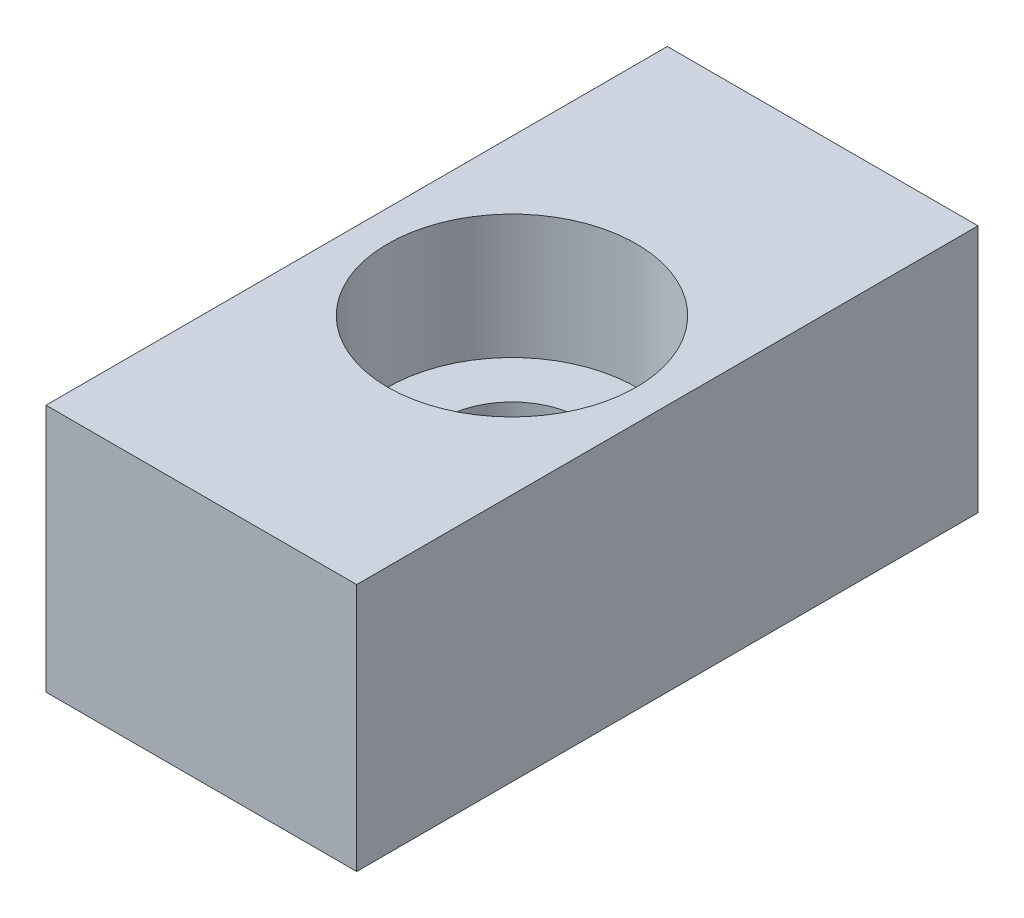
ISO-10303-21;
HEADER;
FILE_DESCRIPTION(('STEP AP214'),'2;1');
FILE_NAME('part.step','',(''),(''),'','','');
FILE_SCHEMA(('AUTOMOTIVE_DESIGN { 1 0 10303 214 1 1 1 1 }'));
ENDSEC;
DATA;
#1=APPLICATION_CONTEXT('core data for automotive mechanical design processes');
#2=APPLICATION_PROTOCOL_DEFINITION('international standard','automotive_design',2000,#1);
#3=PRODUCT_CONTEXT('',#1,'mechanical');
#4=PRODUCT('Part','Part','',(#3));
#5=PRODUCT_RELATED_PRODUCT_CATEGORY('part','',(#4));
#6=PRODUCT_DEFINITION_FORMATION('','',#4);
#7=PRODUCT_DEFINITION_CONTEXT('part definition',#1,'design');
#8=PRODUCT_DEFINITION('design','',#6,#7);
#9=PRODUCT_DEFINITION_SHAPE('','',#8);
#10=(LENGTH_UNIT() NAMED_UNIT(*) SI_UNIT(.MILLI.,.METRE.));
#11=(NAMED_UNIT(*) PLANE_ANGLE_UNIT() SI_UNIT($,.RADIAN.));
#12=(NAMED_UNIT(*) SI_UNIT($,.STERADIAN.) SOLID_ANGLE_UNIT());
#13=UNCERTAINTY_MEASURE_WITH_UNIT(LENGTH_MEASURE(1.E-05),#10,'distance_accuracy_value','');
#14=(GEOMETRIC_REPRESENTATION_CONTEXT(3) GLOBAL_UNCERTAINTY_ASSIGNED_CONTEXT((#13)) GLOBAL_UNIT_ASSIGNED_CONTEXT((#10,
#11,#12)) REPRESENTATION_CONTEXT('',''));
#15=CARTESIAN_POINT('',(0.,0.,0.));
#16=DIRECTION('',(0.,0.,1.));
#17=DIRECTION('',(1.,0.,0.));
#18=AXIS2_PLACEMENT_3D('',#15,#16,#17);
#19=CARTESIAN_POINT('',(0.,4.,0.));
#20=DIRECTION('',(0.,-1.,0.));
#21=DIRECTION('',(0.,0.,-1.));
#22=AXIS2_PLACEMENT_3D('',#19,#20,#21);
#23=PLANE('',#22);
#24=CARTESIAN_POINT('',(0.,4.,0.));
#25=DIRECTION('',(0.,1.,0.));
#26=DIRECTION('',(0.,0.,1.));
#27=AXIS2_PLACEMENT_3D('',#24,#25,#26);
#28=CIRCLE('',#27,2.25);
#29=CARTESIAN_POINT('',(0.,4.,2.25));
#30=VERTEX_POINT('',#29);
#31=EDGE_CURVE('E116',#30,#30,#28,.T.);
#32=ORIENTED_EDGE('',*,*,#31,.F.);
#33=EDGE_LOOP('',(#32));
#34=FACE_BOUND('',#33,.T.);
#35=CARTESIAN_POINT('',(0.,4.,0.));
#36=DIRECTION('',(0.,1.,0.));
#37=DIRECTION('',(0.,0.,1.));
#38=AXIS2_PLACEMENT_3D('',#35,#36,#37);
#39=CIRCLE('',#38,4.);
#40=CARTESIAN_POINT('',(0.,4.,4.));
#41=VERTEX_POINT('',#40);
#42=EDGE_CURVE('E107',#41,#41,#39,.T.);
#43=ORIENTED_EDGE('',*,*,#42,.T.);
#44=EDGE_LOOP('',(#43));
#45=FACE_BOUND('',#44,.T.);
#46=ADVANCED_FACE('F39',(#34,#45),#23,.F.);
#47=CARTESIAN_POINT('',(0.,0.,0.));
#48=DIRECTION('',(0.,-1.,0.));
#49=DIRECTION('',(0.,0.,-1.));
#50=AXIS2_PLACEMENT_3D('',#47,#48,#49);
#51=PLANE('',#50);
#52=DIRECTION('',(0.,0.,-1.));
#53=VECTOR('',#52,1.);
#54=CARTESIAN_POINT('',(5.,0.,10.));
#55=LINE('',#54,#53);
#56=CARTESIAN_POINT('',(5.,0.,10.));
#57=VERTEX_POINT('',#56);
#58=CARTESIAN_POINT('',(5.,0.,-10.));
#59=VERTEX_POINT('',#58);
#60=EDGE_CURVE('E120',#57,#59,#55,.T.);
#61=ORIENTED_EDGE('',*,*,#60,.F.);
#62=DIRECTION('',(1.,0.,0.));
#63=VECTOR('',#62,1.);
#64=CARTESIAN_POINT('',(-5.,0.,10.));
#65=LINE('',#64,#63);
#66=CARTESIAN_POINT('',(-5.,0.,10.));
#67=VERTEX_POINT('',#66);
#68=EDGE_CURVE('E55',#67,#57,#65,.T.);
#69=ORIENTED_EDGE('',*,*,#68,.F.);
#70=DIRECTION('',(0.,0.,1.));
#71=VECTOR('',#70,1.);
#72=CARTESIAN_POINT('',(-5.,0.,10.));
#73=LINE('',#72,#71);
#74=CARTESIAN_POINT('',(-5.,0.,-10.));
#75=VERTEX_POINT('',#74);
#76=EDGE_CURVE('E63',#75,#67,#73,.T.);
#77=ORIENTED_EDGE('',*,*,#76,.F.);
#78=DIRECTION('',(-1.,0.,0.));
#79=VECTOR('',#78,1.);
#80=CARTESIAN_POINT('',(-5.,0.,-10.));
#81=LINE('',#80,#79);
#82=EDGE_CURVE('E127',#59,#75,#81,.T.);
#83=ORIENTED_EDGE('',*,*,#82,.F.);
#84=EDGE_LOOP('',(#61,#69,#77,#83));
#85=FACE_BOUND('',#84,.T.);
#86=CARTESIAN_POINT('',(0.,0.,0.));
#87=DIRECTION('',(0.,1.,0.));
#88=DIRECTION('',(0.,0.,1.));
#89=AXIS2_PLACEMENT_3D('',#86,#87,#88);
#90=CIRCLE('',#89,2.25);
#91=CARTESIAN_POINT('',(0.,0.,2.25));
#92=VERTEX_POINT('',#91);
#93=EDGE_CURVE('E115',#92,#92,#90,.T.);
#94=ORIENTED_EDGE('',*,*,#93,.T.);
#95=EDGE_LOOP('',(#94));
#96=FACE_BOUND('',#95,.T.);
#97=ADVANCED_FACE('F139',(#85,#96),#51,.T.);
#98=CARTESIAN_POINT('',(5.,4.,10.));
#99=DIRECTION('',(-1.,0.,0.));
#100=DIRECTION('',(0.,0.,1.));
#101=AXIS2_PLACEMENT_3D('',#98,#99,#100);
#102=PLANE('',#101);
#103=ORIENTED_EDGE('',*,*,#60,.T.);
#104=DIRECTION('',(0.,-1.,0.));
#105=VECTOR('',#104,1.);
#106=CARTESIAN_POINT('',(5.,4.,-10.));
#107=LINE('',#106,#105);
#108=CARTESIAN_POINT('',(5.,8.,-10.));
#109=VERTEX_POINT('',#108);
#110=EDGE_CURVE('E11',#109,#59,#107,.T.);
#111=ORIENTED_EDGE('',*,*,#110,.F.);
#112=DIRECTION('',(0.,0.,-1.));
#113=VECTOR('',#112,1.);
#114=CARTESIAN_POINT('',(5.,8.,-10.));
#115=LINE('',#114,#113);
#116=CARTESIAN_POINT('',(5.,8.,10.));
#117=VERTEX_POINT('',#116);
#118=EDGE_CURVE('E95',#117,#109,#115,.T.);
#119=ORIENTED_EDGE('',*,*,#118,.F.);
#120=DIRECTION('',(0.,-1.,0.));
#121=VECTOR('',#120,1.);
#122=CARTESIAN_POINT('',(5.,4.,10.));
#123=LINE('',#122,#121);
#124=EDGE_CURVE('E86',#117,#57,#123,.T.);
#125=ORIENTED_EDGE('',*,*,#124,.T.);
#126=EDGE_LOOP('',(#103,#111,#119,#125));
#127=FACE_BOUND('',#126,.T.);
#128=ADVANCED_FACE('F41',(#127),#102,.F.);
#129=CARTESIAN_POINT('',(-5.,4.,-10.));
#130=DIRECTION('',(0.,0.,1.));
#131=DIRECTION('',(1.,0.,0.));
#132=AXIS2_PLACEMENT_3D('',#129,#130,#131);
#133=PLANE('',#132);
#134=ORIENTED_EDGE('',*,*,#82,.T.);
#135=DIRECTION('',(0.,-1.,0.));
#136=VECTOR('',#135,1.);
#137=CARTESIAN_POINT('',(-5.,4.,-10.));
#138=LINE('',#137,#136);
#139=CARTESIAN_POINT('',(-5.,8.,-10.));
#140=VERTEX_POINT('',#139);
#141=EDGE_CURVE('E48',#140,#75,#138,.T.);
#142=ORIENTED_EDGE('',*,*,#141,.F.);
#143=DIRECTION('',(-1.,0.,0.));
#144=VECTOR('',#143,1.);
#145=CARTESIAN_POINT('',(-5.,8.,-10.));
#146=LINE('',#145,#144);
#147=EDGE_CURVE('E101',#109,#140,#146,.T.);
#148=ORIENTED_EDGE('',*,*,#147,.F.);
#149=ORIENTED_EDGE('',*,*,#110,.T.);
#150=EDGE_LOOP('',(#134,#142,#148,#149));
#151=FACE_BOUND('',#150,.T.);
#152=ADVANCED_FACE('F142',(#151),#133,.F.);
#153=CARTESIAN_POINT('',(-5.,4.,10.));
#154=DIRECTION('',(1.,0.,0.));
#155=DIRECTION('',(0.,0.,-1.));
#156=AXIS2_PLACEMENT_3D('',#153,#154,#155);
#157=PLANE('',#156);
#158=ORIENTED_EDGE('',*,*,#76,.T.);
#159=DIRECTION('',(0.,-1.,0.));
#160=VECTOR('',#159,1.);
#161=CARTESIAN_POINT('',(-5.,4.,10.));
#162=LINE('',#161,#160);
#163=CARTESIAN_POINT('',(-5.,8.,10.));
#164=VERTEX_POINT('',#163);
#165=EDGE_CURVE('E80',#164,#67,#162,.T.);
#166=ORIENTED_EDGE('',*,*,#165,.F.);
#167=DIRECTION('',(0.,0.,1.));
#168=VECTOR('',#167,1.);
#169=CARTESIAN_POINT('',(-5.,8.,-10.));
#170=LINE('',#169,#168);
#171=EDGE_CURVE('E84',#140,#164,#170,.T.);
#172=ORIENTED_EDGE('',*,*,#171,.F.);
#173=ORIENTED_EDGE('',*,*,#141,.T.);
#174=EDGE_LOOP('',(#158,#166,#172,#173));
#175=FACE_BOUND('',#174,.T.);
#176=ADVANCED_FACE('F82',(#175),#157,.F.);
#177=CARTESIAN_POINT('',(-5.,4.,10.));
#178=DIRECTION('',(0.,0.,-1.));
#179=DIRECTION('',(-1.,0.,0.));
#180=AXIS2_PLACEMENT_3D('',#177,#178,#179);
#181=PLANE('',#180);
#182=ORIENTED_EDGE('',*,*,#68,.T.);
#183=ORIENTED_EDGE('',*,*,#124,.F.);
#184=DIRECTION('',(1.,0.,0.));
#185=VECTOR('',#184,1.);
#186=CARTESIAN_POINT('',(-5.,8.,10.));
#187=LINE('',#186,#185);
#188=EDGE_CURVE('E89',#164,#117,#187,.T.);
#189=ORIENTED_EDGE('',*,*,#188,.F.);
#190=ORIENTED_EDGE('',*,*,#165,.T.);
#191=EDGE_LOOP('',(#182,#183,#189,#190));
#192=FACE_BOUND('',#191,.T.);
#193=ADVANCED_FACE('F90',(#192),#181,.F.);
#194=CARTESIAN_POINT('',(0.,4.,0.));
#195=DIRECTION('',(0.,-1.,0.));
#196=DIRECTION('',(0.,0.,-1.));
#197=AXIS2_PLACEMENT_3D('',#194,#195,#196);
#198=CYLINDRICAL_SURFACE('',#197,2.25);
#199=ORIENTED_EDGE('',*,*,#31,.T.);
#200=EDGE_LOOP('',(#199));
#201=FACE_BOUND('',#200,.T.);
#202=ORIENTED_EDGE('',*,*,#93,.F.);
#203=EDGE_LOOP('',(#202));
#204=FACE_BOUND('',#203,.T.);
#205=ADVANCED_FACE('F159',(#201,#204),#198,.F.);
#206=CARTESIAN_POINT('',(0.,8.,0.));
#207=DIRECTION('',(0.,1.,0.));
#208=DIRECTION('',(0.,0.,1.));
#209=AXIS2_PLACEMENT_3D('',#206,#207,#208);
#210=PLANE('',#209);
#211=ORIENTED_EDGE('',*,*,#171,.T.);
#212=ORIENTED_EDGE('',*,*,#188,.T.);
#213=ORIENTED_EDGE('',*,*,#118,.T.);
#214=ORIENTED_EDGE('',*,*,#147,.T.);
#215=EDGE_LOOP('',(#211,#212,#213,#214));
#216=FACE_BOUND('',#215,.T.);
#217=CARTESIAN_POINT('',(0.,8.,0.));
#218=DIRECTION('',(0.,1.,0.));
#219=DIRECTION('',(0.,0.,1.));
#220=AXIS2_PLACEMENT_3D('',#217,#218,#219);
#221=CIRCLE('',#220,4.);
#222=CARTESIAN_POINT('',(0.,8.,4.));
#223=VERTEX_POINT('',#222);
#224=EDGE_CURVE('E103',#223,#223,#221,.T.);
#225=ORIENTED_EDGE('',*,*,#224,.F.);
#226=EDGE_LOOP('',(#225));
#227=FACE_BOUND('',#226,.T.);
#228=ADVANCED_FACE('F98',(#216,#227),#210,.T.);
#229=CARTESIAN_POINT('',(0.,8.,0.));
#230=DIRECTION('',(0.,-1.,0.));
#231=DIRECTION('',(0.,0.,-1.));
#232=AXIS2_PLACEMENT_3D('',#229,#230,#231);
#233=CYLINDRICAL_SURFACE('',#232,4.);
#234=ORIENTED_EDGE('',*,*,#224,.T.);
#235=EDGE_LOOP('',(#234));
#236=FACE_BOUND('',#235,.T.);
#237=ORIENTED_EDGE('',*,*,#42,.F.);
#238=EDGE_LOOP('',(#237));
#239=FACE_BOUND('',#238,.T.);
#240=ADVANCED_FACE('F170',(#236,#239),#233,.F.);
#241=CLOSED_SHELL('',(#46,#97,#128,#152,#176,#193,#205,#228,#240));
#242=MANIFOLD_SOLID_BREP('B2',#241);
#243=ADVANCED_BREP_SHAPE_REPRESENTATION('',(#18,#242),#14);
#244=SHAPE_DEFINITION_REPRESENTATION(#9,#243);
ENDSEC;
END-ISO-10303-21;
